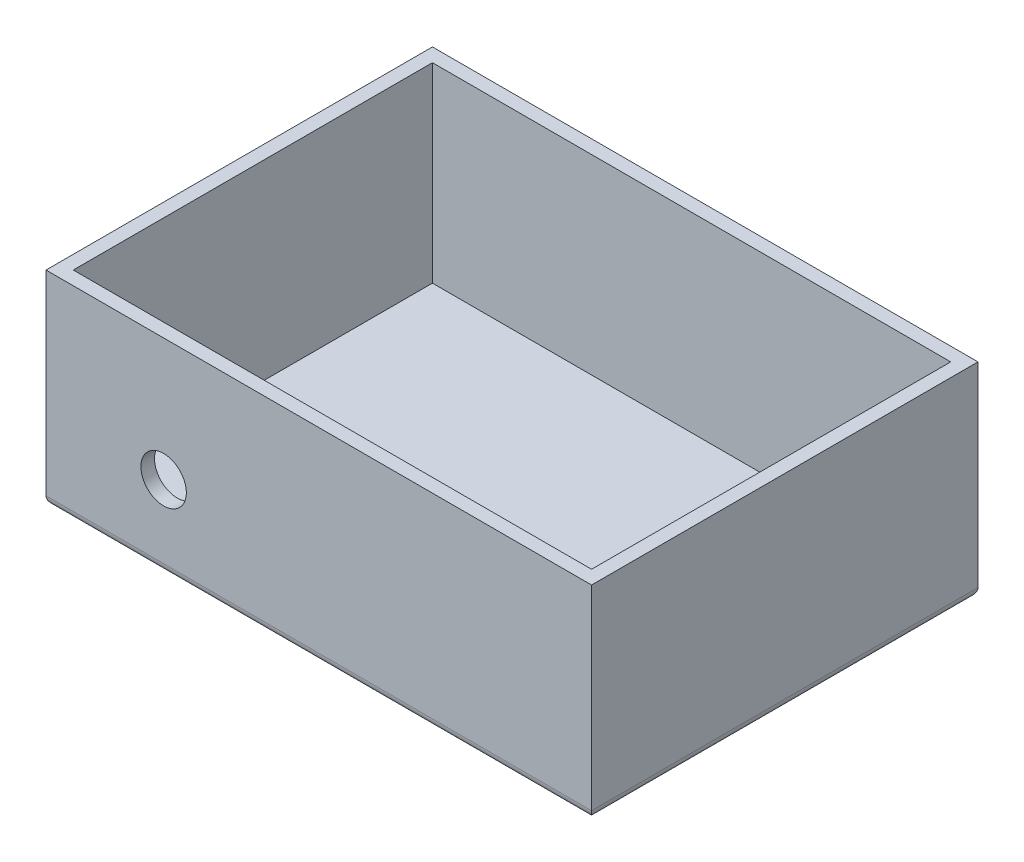
ISO-10303-21;
HEADER;
FILE_DESCRIPTION(('STEP AP214'),'2;1');
FILE_NAME('part.step','',(''),(''),'','','');
FILE_SCHEMA(('AUTOMOTIVE_DESIGN { 1 0 10303 214 1 1 1 1 }'));
ENDSEC;
DATA;
#1=APPLICATION_CONTEXT('core data for automotive mechanical design processes');
#2=APPLICATION_PROTOCOL_DEFINITION('international standard','automotive_design',2000,#1);
#3=PRODUCT_CONTEXT('',#1,'mechanical');
#4=PRODUCT('Part','Part','',(#3));
#5=PRODUCT_RELATED_PRODUCT_CATEGORY('part','',(#4));
#6=PRODUCT_DEFINITION_FORMATION('','',#4);
#7=PRODUCT_DEFINITION_CONTEXT('part definition',#1,'design');
#8=PRODUCT_DEFINITION('design','',#6,#7);
#9=PRODUCT_DEFINITION_SHAPE('','',#8);
#10=(LENGTH_UNIT() NAMED_UNIT(*) SI_UNIT(.MILLI.,.METRE.));
#11=(NAMED_UNIT(*) PLANE_ANGLE_UNIT() SI_UNIT($,.RADIAN.));
#12=(NAMED_UNIT(*) SI_UNIT($,.STERADIAN.) SOLID_ANGLE_UNIT());
#13=UNCERTAINTY_MEASURE_WITH_UNIT(LENGTH_MEASURE(1.E-05),#10,'distance_accuracy_value','');
#14=(GEOMETRIC_REPRESENTATION_CONTEXT(3) GLOBAL_UNCERTAINTY_ASSIGNED_CONTEXT((#13)) GLOBAL_UNIT_ASSIGNED_CONTEXT((#10,
#11,#12)) REPRESENTATION_CONTEXT('',''));
#15=CARTESIAN_POINT('',(0.,0.,0.));
#16=DIRECTION('',(0.,0.,1.));
#17=DIRECTION('',(1.,0.,0.));
#18=AXIS2_PLACEMENT_3D('',#15,#16,#17);
#19=CARTESIAN_POINT('',(-60.,45.,42.5));
#20=DIRECTION('',(1.,0.,0.));
#21=DIRECTION('',(0.,0.,-1.));
#22=AXIS2_PLACEMENT_3D('',#19,#20,#21);
#23=PLANE('',#22);
#24=DIRECTION('',(0.,-1.,0.));
#25=VECTOR('',#24,1.);
#26=CARTESIAN_POINT('',(-60.,45.,-42.5));
#27=LINE('',#26,#25);
#28=CARTESIAN_POINT('',(-60.,45.,-42.5));
#29=VERTEX_POINT('',#28);
#30=CARTESIAN_POINT('',(-60.,2.00000000000002,-42.5));
#31=VERTEX_POINT('',#30);
#32=EDGE_CURVE('E178',#29,#31,#27,.T.);
#33=ORIENTED_EDGE('',*,*,#32,.T.);
#34=DIRECTION('',(0.,0.,1.));
#35=VECTOR('',#34,1.);
#36=CARTESIAN_POINT('',(-60.,2.,42.5));
#37=LINE('',#36,#35);
#38=CARTESIAN_POINT('',(-60.,2.00000000000002,42.5));
#39=VERTEX_POINT('',#38);
#40=EDGE_CURVE('E11',#31,#39,#37,.T.);
#41=ORIENTED_EDGE('',*,*,#40,.T.);
#42=DIRECTION('',(0.,-1.,0.));
#43=VECTOR('',#42,1.);
#44=CARTESIAN_POINT('',(-60.,45.,42.5));
#45=LINE('',#44,#43);
#46=CARTESIAN_POINT('',(-60.,45.,42.5));
#47=VERTEX_POINT('',#46);
#48=EDGE_CURVE('E187',#47,#39,#45,.T.);
#49=ORIENTED_EDGE('',*,*,#48,.F.);
#50=DIRECTION('',(0.,0.,1.));
#51=VECTOR('',#50,1.);
#52=CARTESIAN_POINT('',(-60.,45.,42.5));
#53=LINE('',#52,#51);
#54=EDGE_CURVE('E165',#29,#47,#53,.T.);
#55=ORIENTED_EDGE('',*,*,#54,.F.);
#56=EDGE_LOOP('',(#33,#41,#49,#55));
#57=FACE_BOUND('',#56,.T.);
#58=ADVANCED_FACE('F38',(#57),#23,.F.);
#59=CARTESIAN_POINT('',(60.,45.,42.5));
#60=DIRECTION('',(0.,0.,-1.));
#61=DIRECTION('',(-1.,0.,0.));
#62=AXIS2_PLACEMENT_3D('',#59,#60,#61);
#63=PLANE('',#62);
#64=CARTESIAN_POINT('',(-34.1302870335198,18.,42.5));
#65=DIRECTION('',(0.,0.,-1.));
#66=DIRECTION('',(-1.,0.,0.));
#67=AXIS2_PLACEMENT_3D('',#64,#65,#66);
#68=CIRCLE('',#67,5.);
#69=CARTESIAN_POINT('',(-39.1302870335198,18.,42.5));
#70=VERTEX_POINT('',#69);
#71=EDGE_CURVE('E232',#70,#70,#68,.T.);
#72=ORIENTED_EDGE('',*,*,#71,.T.);
#73=EDGE_LOOP('',(#72));
#74=FACE_BOUND('',#73,.T.);
#75=ORIENTED_EDGE('',*,*,#48,.T.);
#76=DIRECTION('',(1.,0.,0.));
#77=VECTOR('',#76,1.);
#78=CARTESIAN_POINT('',(60.,2.,42.5));
#79=LINE('',#78,#77);
#80=CARTESIAN_POINT('',(60.,2.00000000000002,42.5));
#81=VERTEX_POINT('',#80);
#82=EDGE_CURVE('E191',#39,#81,#79,.T.);
#83=ORIENTED_EDGE('',*,*,#82,.T.);
#84=DIRECTION('',(0.,-1.,0.));
#85=VECTOR('',#84,1.);
#86=CARTESIAN_POINT('',(60.,45.,42.5));
#87=LINE('',#86,#85);
#88=CARTESIAN_POINT('',(60.,45.,42.5));
#89=VERTEX_POINT('',#88);
#90=EDGE_CURVE('E184',#89,#81,#87,.T.);
#91=ORIENTED_EDGE('',*,*,#90,.F.);
#92=DIRECTION('',(1.,0.,0.));
#93=VECTOR('',#92,1.);
#94=CARTESIAN_POINT('',(60.,45.,42.5));
#95=LINE('',#94,#93);
#96=EDGE_CURVE('E169',#47,#89,#95,.T.);
#97=ORIENTED_EDGE('',*,*,#96,.F.);
#98=EDGE_LOOP('',(#75,#83,#91,#97));
#99=FACE_BOUND('',#98,.T.);
#100=ADVANCED_FACE('F267',(#74,#99),#63,.F.);
#101=CARTESIAN_POINT('',(60.,45.,42.5));
#102=DIRECTION('',(-1.,0.,0.));
#103=DIRECTION('',(0.,0.,1.));
#104=AXIS2_PLACEMENT_3D('',#101,#102,#103);
#105=PLANE('',#104);
#106=ORIENTED_EDGE('',*,*,#90,.T.);
#107=DIRECTION('',(0.,0.,-1.));
#108=VECTOR('',#107,1.);
#109=CARTESIAN_POINT('',(60.,2.,42.5));
#110=LINE('',#109,#108);
#111=CARTESIAN_POINT('',(60.,2.00000000000002,-42.5));
#112=VERTEX_POINT('',#111);
#113=EDGE_CURVE('E63',#81,#112,#110,.T.);
#114=ORIENTED_EDGE('',*,*,#113,.T.);
#115=DIRECTION('',(0.,-1.,0.));
#116=VECTOR('',#115,1.);
#117=CARTESIAN_POINT('',(60.,45.,-42.5));
#118=LINE('',#117,#116);
#119=CARTESIAN_POINT('',(60.,45.,-42.5));
#120=VERTEX_POINT('',#119);
#121=EDGE_CURVE('E181',#120,#112,#118,.T.);
#122=ORIENTED_EDGE('',*,*,#121,.F.);
#123=DIRECTION('',(0.,0.,-1.));
#124=VECTOR('',#123,1.);
#125=CARTESIAN_POINT('',(60.,45.,42.5));
#126=LINE('',#125,#124);
#127=EDGE_CURVE('E172',#89,#120,#126,.T.);
#128=ORIENTED_EDGE('',*,*,#127,.F.);
#129=EDGE_LOOP('',(#106,#114,#122,#128));
#130=FACE_BOUND('',#129,.T.);
#131=ADVANCED_FACE('F288',(#130),#105,.F.);
#132=CARTESIAN_POINT('',(60.,45.,-42.5));
#133=DIRECTION('',(0.,0.,1.));
#134=DIRECTION('',(1.,0.,0.));
#135=AXIS2_PLACEMENT_3D('',#132,#133,#134);
#136=PLANE('',#135);
#137=ORIENTED_EDGE('',*,*,#121,.T.);
#138=DIRECTION('',(-1.,0.,0.));
#139=VECTOR('',#138,1.);
#140=CARTESIAN_POINT('',(60.,2.,-42.5));
#141=LINE('',#140,#139);
#142=EDGE_CURVE('E48',#112,#31,#141,.T.);
#143=ORIENTED_EDGE('',*,*,#142,.T.);
#144=ORIENTED_EDGE('',*,*,#32,.F.);
#145=DIRECTION('',(-1.,0.,0.));
#146=VECTOR('',#145,1.);
#147=CARTESIAN_POINT('',(60.,45.,-42.5));
#148=LINE('',#147,#146);
#149=EDGE_CURVE('E175',#120,#29,#148,.T.);
#150=ORIENTED_EDGE('',*,*,#149,.F.);
#151=EDGE_LOOP('',(#137,#143,#144,#150));
#152=FACE_BOUND('',#151,.T.);
#153=ADVANCED_FACE('F258',(#152),#136,.F.);
#154=CARTESIAN_POINT('',(0.,45.,0.));
#155=DIRECTION('',(0.,1.,0.));
#156=DIRECTION('',(0.,0.,1.));
#157=AXIS2_PLACEMENT_3D('',#154,#155,#156);
#158=PLANE('',#157);
#159=DIRECTION('',(0.,0.,1.));
#160=VECTOR('',#159,1.);
#161=CARTESIAN_POINT('',(-57.,45.,42.5));
#162=LINE('',#161,#160);
#163=CARTESIAN_POINT('',(-57.,45.,-39.5));
#164=VERTEX_POINT('',#163);
#165=CARTESIAN_POINT('',(-57.,45.,39.5));
#166=VERTEX_POINT('',#165);
#167=EDGE_CURVE('E149',#164,#166,#162,.T.);
#168=ORIENTED_EDGE('',*,*,#167,.F.);
#169=DIRECTION('',(-1.,0.,0.));
#170=VECTOR('',#169,1.);
#171=CARTESIAN_POINT('',(60.,45.,-39.5));
#172=LINE('',#171,#170);
#173=CARTESIAN_POINT('',(57.,45.,-39.5));
#174=VERTEX_POINT('',#173);
#175=EDGE_CURVE('E162',#174,#164,#172,.T.);
#176=ORIENTED_EDGE('',*,*,#175,.F.);
#177=DIRECTION('',(0.,0.,-1.));
#178=VECTOR('',#177,1.);
#179=CARTESIAN_POINT('',(57.,45.,42.5));
#180=LINE('',#179,#178);
#181=CARTESIAN_POINT('',(57.,45.,39.5));
#182=VERTEX_POINT('',#181);
#183=EDGE_CURVE('E159',#182,#174,#180,.T.);
#184=ORIENTED_EDGE('',*,*,#183,.F.);
#185=DIRECTION('',(1.,0.,0.));
#186=VECTOR('',#185,1.);
#187=CARTESIAN_POINT('',(60.,45.,39.5));
#188=LINE('',#187,#186);
#189=EDGE_CURVE('E135',#166,#182,#188,.T.);
#190=ORIENTED_EDGE('',*,*,#189,.F.);
#191=EDGE_LOOP('',(#168,#176,#184,#190));
#192=FACE_BOUND('',#191,.T.);
#193=ORIENTED_EDGE('',*,*,#54,.T.);
#194=ORIENTED_EDGE('',*,*,#96,.T.);
#195=ORIENTED_EDGE('',*,*,#127,.T.);
#196=ORIENTED_EDGE('',*,*,#149,.T.);
#197=EDGE_LOOP('',(#193,#194,#195,#196));
#198=FACE_BOUND('',#197,.T.);
#199=ADVANCED_FACE('F254',(#192,#198),#158,.T.);
#200=CARTESIAN_POINT('',(0.,0.,0.));
#201=DIRECTION('',(0.,1.,0.));
#202=DIRECTION('',(0.,0.,1.));
#203=AXIS2_PLACEMENT_3D('',#200,#201,#202);
#204=PLANE('',#203);
#205=DIRECTION('',(0.,0.,-1.));
#206=VECTOR('',#205,1.);
#207=CARTESIAN_POINT('',(58.,0.,0.));
#208=LINE('',#207,#206);
#209=CARTESIAN_POINT('',(58.,0.,-40.5));
#210=VERTEX_POINT('',#209);
#211=CARTESIAN_POINT('',(58.,0.,40.5));
#212=VERTEX_POINT('',#211);
#213=EDGE_CURVE('E201',#210,#212,#208,.F.);
#214=ORIENTED_EDGE('',*,*,#213,.T.);
#215=DIRECTION('',(1.,0.,0.));
#216=VECTOR('',#215,1.);
#217=CARTESIAN_POINT('',(0.,0.,40.5));
#218=LINE('',#217,#216);
#219=CARTESIAN_POINT('',(-58.,0.,40.5));
#220=VERTEX_POINT('',#219);
#221=EDGE_CURVE('E204',#212,#220,#218,.F.);
#222=ORIENTED_EDGE('',*,*,#221,.T.);
#223=DIRECTION('',(0.,0.,1.));
#224=VECTOR('',#223,1.);
#225=CARTESIAN_POINT('',(-58.,0.,0.));
#226=LINE('',#225,#224);
#227=CARTESIAN_POINT('',(-58.,0.,-40.5));
#228=VERTEX_POINT('',#227);
#229=EDGE_CURVE('E195',#220,#228,#226,.F.);
#230=ORIENTED_EDGE('',*,*,#229,.T.);
#231=DIRECTION('',(-1.,0.,0.));
#232=VECTOR('',#231,1.);
#233=CARTESIAN_POINT('',(0.,0.,-40.5));
#234=LINE('',#233,#232);
#235=EDGE_CURVE('E198',#228,#210,#234,.F.);
#236=ORIENTED_EDGE('',*,*,#235,.T.);
#237=EDGE_LOOP('',(#214,#222,#230,#236));
#238=FACE_BOUND('',#237,.T.);
#239=ADVANCED_FACE('F257',(#238),#204,.F.);
#240=CARTESIAN_POINT('',(-57.,45.,42.5));
#241=DIRECTION('',(1.,0.,0.));
#242=DIRECTION('',(0.,0.,-1.));
#243=AXIS2_PLACEMENT_3D('',#240,#241,#242);
#244=PLANE('',#243);
#245=DIRECTION('',(0.,0.,1.));
#246=VECTOR('',#245,1.);
#247=CARTESIAN_POINT('',(-57.,3.,42.5));
#248=LINE('',#247,#246);
#249=CARTESIAN_POINT('',(-57.,3.,-39.5));
#250=VERTEX_POINT('',#249);
#251=CARTESIAN_POINT('',(-57.,3.,39.5));
#252=VERTEX_POINT('',#251);
#253=EDGE_CURVE('E125',#250,#252,#248,.T.);
#254=ORIENTED_EDGE('',*,*,#253,.F.);
#255=DIRECTION('',(0.,-1.,0.));
#256=VECTOR('',#255,1.);
#257=CARTESIAN_POINT('',(-57.,45.,-39.5));
#258=LINE('',#257,#256);
#259=EDGE_CURVE('E153',#164,#250,#258,.T.);
#260=ORIENTED_EDGE('',*,*,#259,.F.);
#261=ORIENTED_EDGE('',*,*,#167,.T.);
#262=DIRECTION('',(0.,-1.,0.));
#263=VECTOR('',#262,1.);
#264=CARTESIAN_POINT('',(-57.,45.,39.5));
#265=LINE('',#264,#263);
#266=EDGE_CURVE('E140',#166,#252,#265,.T.);
#267=ORIENTED_EDGE('',*,*,#266,.T.);
#268=EDGE_LOOP('',(#254,#260,#261,#267));
#269=FACE_BOUND('',#268,.T.);
#270=ADVANCED_FACE('F252',(#269),#244,.T.);
#271=CARTESIAN_POINT('',(60.,45.,39.5));
#272=DIRECTION('',(0.,0.,-1.));
#273=DIRECTION('',(-1.,0.,0.));
#274=AXIS2_PLACEMENT_3D('',#271,#272,#273);
#275=PLANE('',#274);
#276=CARTESIAN_POINT('',(-34.1302870335198,18.,39.5));
#277=DIRECTION('',(0.,0.,-1.));
#278=DIRECTION('',(-1.,0.,0.));
#279=AXIS2_PLACEMENT_3D('',#276,#277,#278);
#280=CIRCLE('',#279,5.);
#281=CARTESIAN_POINT('',(-39.1302870335198,18.,39.5));
#282=VERTEX_POINT('',#281);
#283=EDGE_CURVE('E225',#282,#282,#280,.T.);
#284=ORIENTED_EDGE('',*,*,#283,.F.);
#285=EDGE_LOOP('',(#284));
#286=FACE_BOUND('',#285,.T.);
#287=DIRECTION('',(1.,0.,0.));
#288=VECTOR('',#287,1.);
#289=CARTESIAN_POINT('',(60.,3.,39.5));
#290=LINE('',#289,#288);
#291=CARTESIAN_POINT('',(57.,3.,39.5));
#292=VERTEX_POINT('',#291);
#293=EDGE_CURVE('E118',#252,#292,#290,.T.);
#294=ORIENTED_EDGE('',*,*,#293,.F.);
#295=ORIENTED_EDGE('',*,*,#266,.F.);
#296=ORIENTED_EDGE('',*,*,#189,.T.);
#297=DIRECTION('',(0.,-1.,0.));
#298=VECTOR('',#297,1.);
#299=CARTESIAN_POINT('',(57.,45.,39.5));
#300=LINE('',#299,#298);
#301=EDGE_CURVE('E132',#182,#292,#300,.T.);
#302=ORIENTED_EDGE('',*,*,#301,.T.);
#303=EDGE_LOOP('',(#294,#295,#296,#302));
#304=FACE_BOUND('',#303,.T.);
#305=ADVANCED_FACE('F133',(#286,#304),#275,.T.);
#306=CARTESIAN_POINT('',(57.,45.,42.5));
#307=DIRECTION('',(-1.,0.,0.));
#308=DIRECTION('',(0.,0.,1.));
#309=AXIS2_PLACEMENT_3D('',#306,#307,#308);
#310=PLANE('',#309);
#311=DIRECTION('',(0.,0.,-1.));
#312=VECTOR('',#311,1.);
#313=CARTESIAN_POINT('',(57.,3.,42.5));
#314=LINE('',#313,#312);
#315=CARTESIAN_POINT('',(57.,3.,-39.5));
#316=VERTEX_POINT('',#315);
#317=EDGE_CURVE('E122',#292,#316,#314,.T.);
#318=ORIENTED_EDGE('',*,*,#317,.F.);
#319=ORIENTED_EDGE('',*,*,#301,.F.);
#320=ORIENTED_EDGE('',*,*,#183,.T.);
#321=DIRECTION('',(0.,-1.,0.));
#322=VECTOR('',#321,1.);
#323=CARTESIAN_POINT('',(57.,45.,-39.5));
#324=LINE('',#323,#322);
#325=EDGE_CURVE('E141',#174,#316,#324,.T.);
#326=ORIENTED_EDGE('',*,*,#325,.T.);
#327=EDGE_LOOP('',(#318,#319,#320,#326));
#328=FACE_BOUND('',#327,.T.);
#329=ADVANCED_FACE('F143',(#328),#310,.T.);
#330=CARTESIAN_POINT('',(60.,45.,-39.5));
#331=DIRECTION('',(0.,0.,1.));
#332=DIRECTION('',(1.,0.,0.));
#333=AXIS2_PLACEMENT_3D('',#330,#331,#332);
#334=PLANE('',#333);
#335=DIRECTION('',(-1.,0.,0.));
#336=VECTOR('',#335,1.);
#337=CARTESIAN_POINT('',(60.,3.,-39.5));
#338=LINE('',#337,#336);
#339=EDGE_CURVE('E146',#316,#250,#338,.T.);
#340=ORIENTED_EDGE('',*,*,#339,.F.);
#341=ORIENTED_EDGE('',*,*,#325,.F.);
#342=ORIENTED_EDGE('',*,*,#175,.T.);
#343=ORIENTED_EDGE('',*,*,#259,.T.);
#344=EDGE_LOOP('',(#340,#341,#342,#343));
#345=FACE_BOUND('',#344,.T.);
#346=ADVANCED_FACE('F248',(#345),#334,.T.);
#347=CARTESIAN_POINT('',(0.,3.,0.));
#348=DIRECTION('',(0.,1.,0.));
#349=DIRECTION('',(0.,0.,1.));
#350=AXIS2_PLACEMENT_3D('',#347,#348,#349);
#351=PLANE('',#350);
#352=ORIENTED_EDGE('',*,*,#253,.T.);
#353=ORIENTED_EDGE('',*,*,#293,.T.);
#354=ORIENTED_EDGE('',*,*,#317,.T.);
#355=ORIENTED_EDGE('',*,*,#339,.T.);
#356=EDGE_LOOP('',(#352,#353,#354,#355));
#357=FACE_BOUND('',#356,.T.);
#358=ADVANCED_FACE('F120',(#357),#351,.T.);
#359=CARTESIAN_POINT('',(-34.1302870335198,18.,84.5));
#360=DIRECTION('',(0.,0.,-1.));
#361=DIRECTION('',(-1.,0.,0.));
#362=AXIS2_PLACEMENT_3D('',#359,#360,#361);
#363=CYLINDRICAL_SURFACE('',#362,5.);
#364=ORIENTED_EDGE('',*,*,#283,.T.);
#365=EDGE_LOOP('',(#364));
#366=FACE_BOUND('',#365,.T.);
#367=ORIENTED_EDGE('',*,*,#71,.F.);
#368=EDGE_LOOP('',(#367));
#369=FACE_BOUND('',#368,.T.);
#370=ADVANCED_FACE('F301',(#366,#369),#363,.F.);
#371=CARTESIAN_POINT('',(60.,2.,-40.5));
#372=DIRECTION('',(-1.,0.,0.));
#373=DIRECTION('',(0.,0.,1.));
#374=AXIS2_PLACEMENT_3D('',#371,#372,#373);
#375=CYLINDRICAL_SURFACE('',#374,2.);
#376=CARTESIAN_POINT('',(58.,2.,-40.5));
#377=DIRECTION('',(-0.707106781186548,0.,-0.707106781186547));
#378=DIRECTION('',(-0.707106781186547,0.,0.707106781186548));
#379=AXIS2_PLACEMENT_3D('',#376,#377,#378);
#380=ELLIPSE('',#379,2.82842712474619,2.);
#381=EDGE_CURVE('E217',#210,#112,#380,.F.);
#382=ORIENTED_EDGE('',*,*,#381,.F.);
#383=ORIENTED_EDGE('',*,*,#235,.F.);
#384=CARTESIAN_POINT('',(-58.,2.,-40.5));
#385=DIRECTION('',(-0.707106781186547,0.,0.707106781186548));
#386=DIRECTION('',(0.707106781186548,0.,0.707106781186547));
#387=AXIS2_PLACEMENT_3D('',#384,#385,#386);
#388=ELLIPSE('',#387,2.82842712474619,2.);
#389=EDGE_CURVE('E42',#31,#228,#388,.T.);
#390=ORIENTED_EDGE('',*,*,#389,.F.);
#391=ORIENTED_EDGE('',*,*,#142,.F.);
#392=EDGE_LOOP('',(#382,#383,#390,#391));
#393=FACE_BOUND('',#392,.T.);
#394=ADVANCED_FACE('F40',(#393),#375,.T.);
#395=CARTESIAN_POINT('',(-58.,2.,42.5));
#396=DIRECTION('',(0.,0.,1.));
#397=DIRECTION('',(1.,0.,0.));
#398=AXIS2_PLACEMENT_3D('',#395,#396,#397);
#399=CYLINDRICAL_SURFACE('',#398,2.);
#400=ORIENTED_EDGE('',*,*,#389,.T.);
#401=ORIENTED_EDGE('',*,*,#229,.F.);
#402=CARTESIAN_POINT('',(-58.,2.,40.5));
#403=DIRECTION('',(0.707106781186548,0.,0.707106781186547));
#404=DIRECTION('',(-0.707106781186547,0.,0.707106781186548));
#405=AXIS2_PLACEMENT_3D('',#402,#403,#404);
#406=ELLIPSE('',#405,2.82842712474619,2.);
#407=EDGE_CURVE('E215',#39,#220,#406,.T.);
#408=ORIENTED_EDGE('',*,*,#407,.F.);
#409=ORIENTED_EDGE('',*,*,#40,.F.);
#410=EDGE_LOOP('',(#400,#401,#408,#409));
#411=FACE_BOUND('',#410,.T.);
#412=ADVANCED_FACE('F269',(#411),#399,.T.);
#413=CARTESIAN_POINT('',(58.,2.,42.5));
#414=DIRECTION('',(0.,0.,-1.));
#415=DIRECTION('',(-1.,0.,0.));
#416=AXIS2_PLACEMENT_3D('',#413,#414,#415);
#417=CYLINDRICAL_SURFACE('',#416,2.);
#418=ORIENTED_EDGE('',*,*,#381,.T.);
#419=ORIENTED_EDGE('',*,*,#113,.F.);
#420=CARTESIAN_POINT('',(58.,2.,40.5));
#421=DIRECTION('',(0.707106781186547,0.,-0.707106781186548));
#422=DIRECTION('',(-0.707106781186548,0.,-0.707106781186547));
#423=AXIS2_PLACEMENT_3D('',#420,#421,#422);
#424=ELLIPSE('',#423,2.82842712474619,2.);
#425=EDGE_CURVE('E212',#212,#81,#424,.F.);
#426=ORIENTED_EDGE('',*,*,#425,.F.);
#427=ORIENTED_EDGE('',*,*,#213,.F.);
#428=EDGE_LOOP('',(#418,#419,#426,#427));
#429=FACE_BOUND('',#428,.T.);
#430=ADVANCED_FACE('F274',(#429),#417,.T.);
#431=CARTESIAN_POINT('',(60.,2.,40.5));
#432=DIRECTION('',(1.,0.,0.));
#433=DIRECTION('',(0.,0.,-1.));
#434=AXIS2_PLACEMENT_3D('',#431,#432,#433);
#435=CYLINDRICAL_SURFACE('',#434,2.);
#436=ORIENTED_EDGE('',*,*,#407,.T.);
#437=ORIENTED_EDGE('',*,*,#221,.F.);
#438=ORIENTED_EDGE('',*,*,#425,.T.);
#439=ORIENTED_EDGE('',*,*,#82,.F.);
#440=EDGE_LOOP('',(#436,#437,#438,#439));
#441=FACE_BOUND('',#440,.T.);
#442=ADVANCED_FACE('F272',(#441),#435,.T.);
#443=CLOSED_SHELL('',(#58,#100,#131,#153,#199,#239,#270,#305,#329,#346,#358,#370,#394,#412,#430,#442));
#444=MANIFOLD_SOLID_BREP('B2',#443);
#445=ADVANCED_BREP_SHAPE_REPRESENTATION('',(#18,#444),#14);
#446=SHAPE_DEFINITION_REPRESENTATION(#9,#445);
ENDSEC;
END-ISO-10303-21;
